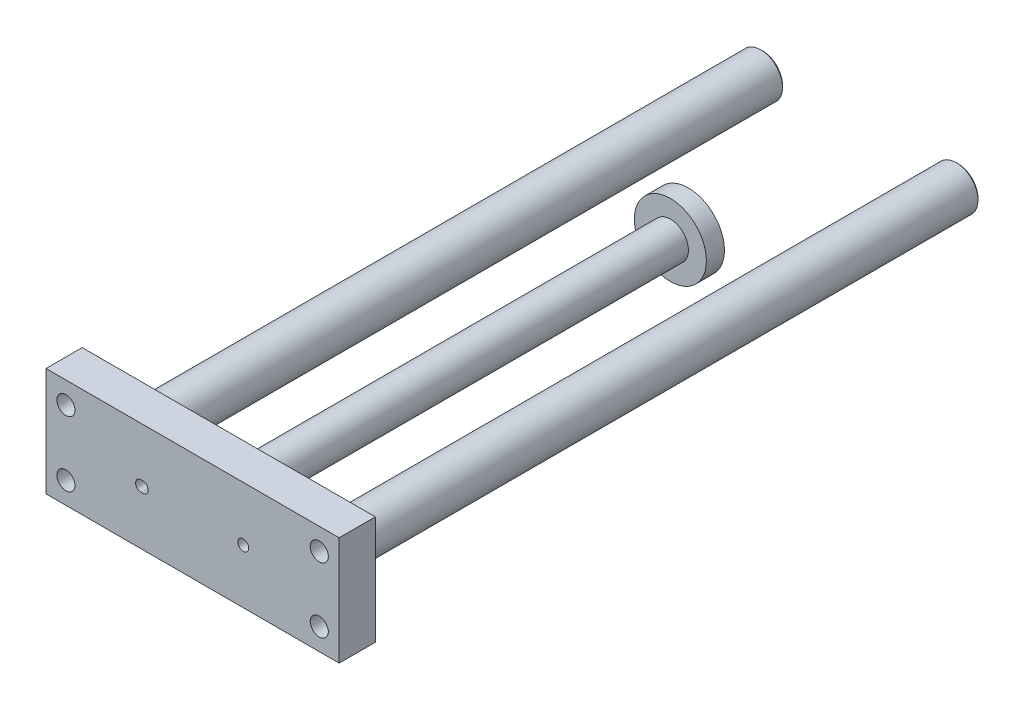
ISO-10303-21;
HEADER;
FILE_DESCRIPTION(('STEP AP214'),'2;1');
FILE_NAME('part.step','',(''),(''),'','','');
FILE_SCHEMA(('AUTOMOTIVE_DESIGN { 1 0 10303 214 1 1 1 1 }'));
ENDSEC;
DATA;
#1=APPLICATION_CONTEXT('core data for automotive mechanical design processes');
#2=APPLICATION_PROTOCOL_DEFINITION('international standard','automotive_design',2000,#1);
#3=PRODUCT_CONTEXT('',#1,'mechanical');
#4=PRODUCT('Part','Part','',(#3));
#5=PRODUCT_RELATED_PRODUCT_CATEGORY('part','',(#4));
#6=PRODUCT_DEFINITION_FORMATION('','',#4);
#7=PRODUCT_DEFINITION_CONTEXT('part definition',#1,'design');
#8=PRODUCT_DEFINITION('design','',#6,#7);
#9=PRODUCT_DEFINITION_SHAPE('','',#8);
#10=(LENGTH_UNIT() NAMED_UNIT(*) SI_UNIT(.MILLI.,.METRE.));
#11=(NAMED_UNIT(*) PLANE_ANGLE_UNIT() SI_UNIT($,.RADIAN.));
#12=(NAMED_UNIT(*) SI_UNIT($,.STERADIAN.) SOLID_ANGLE_UNIT());
#13=UNCERTAINTY_MEASURE_WITH_UNIT(LENGTH_MEASURE(1.E-05),#10,'distance_accuracy_value','');
#14=(GEOMETRIC_REPRESENTATION_CONTEXT(3) GLOBAL_UNCERTAINTY_ASSIGNED_CONTEXT((#13)) GLOBAL_UNIT_ASSIGNED_CONTEXT((#10,
#11,#12)) REPRESENTATION_CONTEXT('',''));
#15=CARTESIAN_POINT('',(0.,0.,0.));
#16=DIRECTION('',(0.,0.,1.));
#17=DIRECTION('',(1.,0.,0.));
#18=AXIS2_PLACEMENT_3D('',#15,#16,#17);
#19=CARTESIAN_POINT('',(-40.5,-15.,127.));
#20=DIRECTION('',(0.,0.,1.));
#21=DIRECTION('',(1.,0.,0.));
#22=AXIS2_PLACEMENT_3D('',#19,#20,#21);
#23=PLANE('',#22);
#24=CARTESIAN_POINT('',(-35.,-9.,127.));
#25=DIRECTION('',(0.,0.,1.));
#26=DIRECTION('',(1.,0.,0.));
#27=AXIS2_PLACEMENT_3D('',#24,#25,#26);
#28=CIRCLE('',#27,2.5);
#29=CARTESIAN_POINT('',(-32.5,-9.,127.));
#30=VERTEX_POINT('',#29);
#31=EDGE_CURVE('E159',#30,#30,#28,.T.);
#32=ORIENTED_EDGE('',*,*,#31,.T.);
#33=EDGE_LOOP('',(#32));
#34=FACE_BOUND('',#33,.T.);
#35=CARTESIAN_POINT('',(35.,-9.,127.));
#36=DIRECTION('',(0.,0.,1.));
#37=DIRECTION('',(1.,0.,0.));
#38=AXIS2_PLACEMENT_3D('',#35,#36,#37);
#39=CIRCLE('',#38,2.5);
#40=CARTESIAN_POINT('',(37.5,-9.,127.));
#41=VERTEX_POINT('',#40);
#42=EDGE_CURVE('E165',#41,#41,#39,.T.);
#43=ORIENTED_EDGE('',*,*,#42,.T.);
#44=EDGE_LOOP('',(#43));
#45=FACE_BOUND('',#44,.T.);
#46=CARTESIAN_POINT('',(-35.,9.,127.));
#47=DIRECTION('',(0.,0.,1.));
#48=DIRECTION('',(1.,0.,0.));
#49=AXIS2_PLACEMENT_3D('',#46,#47,#48);
#50=CIRCLE('',#49,2.5);
#51=CARTESIAN_POINT('',(-32.5,9.,127.));
#52=VERTEX_POINT('',#51);
#53=EDGE_CURVE('E171',#52,#52,#50,.T.);
#54=ORIENTED_EDGE('',*,*,#53,.T.);
#55=EDGE_LOOP('',(#54));
#56=FACE_BOUND('',#55,.T.);
#57=CARTESIAN_POINT('',(35.,9.,127.));
#58=DIRECTION('',(0.,0.,1.));
#59=DIRECTION('',(1.,0.,0.));
#60=AXIS2_PLACEMENT_3D('',#57,#58,#59);
#61=CIRCLE('',#60,2.5);
#62=CARTESIAN_POINT('',(37.5,9.,127.));
#63=VERTEX_POINT('',#62);
#64=EDGE_CURVE('E177',#63,#63,#61,.T.);
#65=ORIENTED_EDGE('',*,*,#64,.T.);
#66=EDGE_LOOP('',(#65));
#67=FACE_BOUND('',#66,.T.);
#68=CARTESIAN_POINT('',(27.,0.,127.));
#69=DIRECTION('',(0.,0.,1.));
#70=DIRECTION('',(1.,0.,0.));
#71=AXIS2_PLACEMENT_3D('',#68,#69,#70);
#72=CIRCLE('',#71,6.);
#73=CARTESIAN_POINT('',(33.,0.,127.));
#74=VERTEX_POINT('',#73);
#75=EDGE_CURVE('E222',#74,#74,#72,.F.);
#76=ORIENTED_EDGE('',*,*,#75,.F.);
#77=EDGE_LOOP('',(#76));
#78=FACE_BOUND('',#77,.T.);
#79=DIRECTION('',(0.,-1.,0.));
#80=VECTOR('',#79,1.);
#81=CARTESIAN_POINT('',(-40.5,15.,127.));
#82=LINE('',#81,#80);
#83=CARTESIAN_POINT('',(-40.5,15.,127.));
#84=VERTEX_POINT('',#83);
#85=CARTESIAN_POINT('',(-40.5,-15.,127.));
#86=VERTEX_POINT('',#85);
#87=EDGE_CURVE('E187',#84,#86,#82,.T.);
#88=ORIENTED_EDGE('',*,*,#87,.F.);
#89=DIRECTION('',(-1.,0.,0.));
#90=VECTOR('',#89,1.);
#91=CARTESIAN_POINT('',(-40.5,15.,127.));
#92=LINE('',#91,#90);
#93=CARTESIAN_POINT('',(40.5,15.,127.));
#94=VERTEX_POINT('',#93);
#95=EDGE_CURVE('E79',#94,#84,#92,.T.);
#96=ORIENTED_EDGE('',*,*,#95,.F.);
#97=DIRECTION('',(0.,1.,0.));
#98=VECTOR('',#97,1.);
#99=CARTESIAN_POINT('',(40.5,15.,127.));
#100=LINE('',#99,#98);
#101=CARTESIAN_POINT('',(40.5,-15.,127.));
#102=VERTEX_POINT('',#101);
#103=EDGE_CURVE('E201',#102,#94,#100,.T.);
#104=ORIENTED_EDGE('',*,*,#103,.F.);
#105=DIRECTION('',(1.,0.,0.));
#106=VECTOR('',#105,1.);
#107=CARTESIAN_POINT('',(-40.5,-15.,127.));
#108=LINE('',#107,#106);
#109=EDGE_CURVE('E199',#86,#102,#108,.T.);
#110=ORIENTED_EDGE('',*,*,#109,.F.);
#111=EDGE_LOOP('',(#88,#96,#104,#110));
#112=FACE_BOUND('',#111,.T.);
#113=CARTESIAN_POINT('',(0.,0.,127.));
#114=DIRECTION('',(0.,0.,1.));
#115=DIRECTION('',(1.,0.,0.));
#116=AXIS2_PLACEMENT_3D('',#113,#114,#115);
#117=CIRCLE('',#116,5.);
#118=CARTESIAN_POINT('',(5.,0.,127.));
#119=VERTEX_POINT('',#118);
#120=EDGE_CURVE('E212',#119,#119,#117,.T.);
#121=ORIENTED_EDGE('',*,*,#120,.T.);
#122=EDGE_LOOP('',(#121));
#123=FACE_BOUND('',#122,.T.);
#124=CARTESIAN_POINT('',(-27.,0.,127.));
#125=DIRECTION('',(0.,0.,1.));
#126=DIRECTION('',(1.,0.,0.));
#127=AXIS2_PLACEMENT_3D('',#124,#125,#126);
#128=CIRCLE('',#127,6.);
#129=CARTESIAN_POINT('',(-21.,0.,127.));
#130=VERTEX_POINT('',#129);
#131=EDGE_CURVE('E227',#130,#130,#128,.F.);
#132=ORIENTED_EDGE('',*,*,#131,.F.);
#133=EDGE_LOOP('',(#132));
#134=FACE_BOUND('',#133,.T.);
#135=ADVANCED_FACE('F34',(#34,#45,#56,#67,#78,#112,#123,#134),#23,.F.);
#136=CARTESIAN_POINT('',(0.,0.,5.));
#137=DIRECTION('',(0.,0.,1.));
#138=DIRECTION('',(1.,0.,0.));
#139=AXIS2_PLACEMENT_3D('',#136,#137,#138);
#140=PLANE('',#139);
#141=CARTESIAN_POINT('',(0.,0.,5.));
#142=DIRECTION('',(0.,0.,1.));
#143=DIRECTION('',(1.,0.,0.));
#144=AXIS2_PLACEMENT_3D('',#141,#142,#143);
#145=CIRCLE('',#144,9.95);
#146=CARTESIAN_POINT('',(9.95,0.,5.));
#147=VERTEX_POINT('',#146);
#148=EDGE_CURVE('E219',#147,#147,#145,.T.);
#149=ORIENTED_EDGE('',*,*,#148,.T.);
#150=EDGE_LOOP('',(#149));
#151=FACE_BOUND('',#150,.T.);
#152=CARTESIAN_POINT('',(0.,0.,5.));
#153=DIRECTION('',(0.,0.,1.));
#154=DIRECTION('',(1.,0.,0.));
#155=AXIS2_PLACEMENT_3D('',#152,#153,#154);
#156=CIRCLE('',#155,5.);
#157=CARTESIAN_POINT('',(5.,0.,5.));
#158=VERTEX_POINT('',#157);
#159=EDGE_CURVE('E215',#158,#158,#156,.F.);
#160=ORIENTED_EDGE('',*,*,#159,.T.);
#161=EDGE_LOOP('',(#160));
#162=FACE_BOUND('',#161,.T.);
#163=ADVANCED_FACE('F265',(#151,#162),#140,.T.);
#164=CARTESIAN_POINT('',(0.,0.,5.));
#165=DIRECTION('',(0.,0.,-1.));
#166=DIRECTION('',(-1.,0.,0.));
#167=AXIS2_PLACEMENT_3D('',#164,#165,#166);
#168=CYLINDRICAL_SURFACE('',#167,9.95);
#169=ORIENTED_EDGE('',*,*,#148,.F.);
#170=EDGE_LOOP('',(#169));
#171=FACE_BOUND('',#170,.T.);
#172=CARTESIAN_POINT('',(0.,0.,0.));
#173=DIRECTION('',(0.,0.,1.));
#174=DIRECTION('',(1.,0.,0.));
#175=AXIS2_PLACEMENT_3D('',#172,#173,#174);
#176=CIRCLE('',#175,9.95);
#177=CARTESIAN_POINT('',(9.95,0.,0.));
#178=VERTEX_POINT('',#177);
#179=EDGE_CURVE('E218',#178,#178,#176,.T.);
#180=ORIENTED_EDGE('',*,*,#179,.T.);
#181=EDGE_LOOP('',(#180));
#182=FACE_BOUND('',#181,.T.);
#183=ADVANCED_FACE('F271',(#171,#182),#168,.T.);
#184=CARTESIAN_POINT('',(0.,0.,0.));
#185=DIRECTION('',(0.,0.,1.));
#186=DIRECTION('',(1.,0.,0.));
#187=AXIS2_PLACEMENT_3D('',#184,#185,#186);
#188=PLANE('',#187);
#189=ORIENTED_EDGE('',*,*,#179,.F.);
#190=EDGE_LOOP('',(#189));
#191=FACE_BOUND('',#190,.T.);
#192=ADVANCED_FACE('F295',(#191),#188,.F.);
#193=CARTESIAN_POINT('',(0.,0.,141.142135623731));
#194=DIRECTION('',(0.,0.,-1.));
#195=DIRECTION('',(-1.,0.,0.));
#196=AXIS2_PLACEMENT_3D('',#193,#194,#195);
#197=CYLINDRICAL_SURFACE('',#196,5.);
#198=ORIENTED_EDGE('',*,*,#159,.F.);
#199=EDGE_LOOP('',(#198));
#200=FACE_BOUND('',#199,.T.);
#201=ORIENTED_EDGE('',*,*,#120,.F.);
#202=EDGE_LOOP('',(#201));
#203=FACE_BOUND('',#202,.T.);
#204=ADVANCED_FACE('F292',(#200,#203),#197,.T.);
#205=CARTESIAN_POINT('',(-40.5,15.,137.));
#206=DIRECTION('',(1.,0.,0.));
#207=DIRECTION('',(0.,0.,-1.));
#208=AXIS2_PLACEMENT_3D('',#205,#206,#207);
#209=PLANE('',#208);
#210=ORIENTED_EDGE('',*,*,#87,.T.);
#211=DIRECTION('',(0.,0.,-1.));
#212=VECTOR('',#211,1.);
#213=CARTESIAN_POINT('',(-40.5,-15.,137.));
#214=LINE('',#213,#212);
#215=CARTESIAN_POINT('',(-40.5,-15.,137.));
#216=VERTEX_POINT('',#215);
#217=EDGE_CURVE('E210',#216,#86,#214,.T.);
#218=ORIENTED_EDGE('',*,*,#217,.F.);
#219=DIRECTION('',(0.,-1.,0.));
#220=VECTOR('',#219,1.);
#221=CARTESIAN_POINT('',(-40.5,15.,137.));
#222=LINE('',#221,#220);
#223=CARTESIAN_POINT('',(-40.5,15.,137.));
#224=VERTEX_POINT('',#223);
#225=EDGE_CURVE('E190',#224,#216,#222,.T.);
#226=ORIENTED_EDGE('',*,*,#225,.F.);
#227=DIRECTION('',(0.,0.,-1.));
#228=VECTOR('',#227,1.);
#229=CARTESIAN_POINT('',(-40.5,15.,137.));
#230=LINE('',#229,#228);
#231=EDGE_CURVE('E196',#224,#84,#230,.T.);
#232=ORIENTED_EDGE('',*,*,#231,.T.);
#233=EDGE_LOOP('',(#210,#218,#226,#232));
#234=FACE_BOUND('',#233,.T.);
#235=ADVANCED_FACE('F289',(#234),#209,.F.);
#236=CARTESIAN_POINT('',(-40.5,-15.,137.));
#237=DIRECTION('',(0.,1.,0.));
#238=DIRECTION('',(0.,0.,1.));
#239=AXIS2_PLACEMENT_3D('',#236,#237,#238);
#240=PLANE('',#239);
#241=ORIENTED_EDGE('',*,*,#109,.T.);
#242=DIRECTION('',(0.,0.,-1.));
#243=VECTOR('',#242,1.);
#244=CARTESIAN_POINT('',(40.5,-15.,137.));
#245=LINE('',#244,#243);
#246=CARTESIAN_POINT('',(40.5,-15.,137.));
#247=VERTEX_POINT('',#246);
#248=EDGE_CURVE('E207',#247,#102,#245,.T.);
#249=ORIENTED_EDGE('',*,*,#248,.F.);
#250=DIRECTION('',(1.,0.,0.));
#251=VECTOR('',#250,1.);
#252=CARTESIAN_POINT('',(-40.5,-15.,137.));
#253=LINE('',#252,#251);
#254=EDGE_CURVE('E87',#216,#247,#253,.T.);
#255=ORIENTED_EDGE('',*,*,#254,.F.);
#256=ORIENTED_EDGE('',*,*,#217,.T.);
#257=EDGE_LOOP('',(#241,#249,#255,#256));
#258=FACE_BOUND('',#257,.T.);
#259=ADVANCED_FACE('F285',(#258),#240,.F.);
#260=CARTESIAN_POINT('',(40.5,15.,137.));
#261=DIRECTION('',(-1.,0.,0.));
#262=DIRECTION('',(0.,0.,1.));
#263=AXIS2_PLACEMENT_3D('',#260,#261,#262);
#264=PLANE('',#263);
#265=ORIENTED_EDGE('',*,*,#103,.T.);
#266=DIRECTION('',(0.,0.,-1.));
#267=VECTOR('',#266,1.);
#268=CARTESIAN_POINT('',(40.5,15.,137.));
#269=LINE('',#268,#267);
#270=CARTESIAN_POINT('',(40.5,15.,137.));
#271=VERTEX_POINT('',#270);
#272=EDGE_CURVE('E205',#271,#94,#269,.T.);
#273=ORIENTED_EDGE('',*,*,#272,.F.);
#274=DIRECTION('',(0.,1.,0.));
#275=VECTOR('',#274,1.);
#276=CARTESIAN_POINT('',(40.5,15.,137.));
#277=LINE('',#276,#275);
#278=EDGE_CURVE('E193',#247,#271,#277,.T.);
#279=ORIENTED_EDGE('',*,*,#278,.F.);
#280=ORIENTED_EDGE('',*,*,#248,.T.);
#281=EDGE_LOOP('',(#265,#273,#279,#280));
#282=FACE_BOUND('',#281,.T.);
#283=ADVANCED_FACE('F282',(#282),#264,.F.);
#284=CARTESIAN_POINT('',(-40.5,15.,137.));
#285=DIRECTION('',(0.,-1.,0.));
#286=DIRECTION('',(0.,0.,-1.));
#287=AXIS2_PLACEMENT_3D('',#284,#285,#286);
#288=PLANE('',#287);
#289=ORIENTED_EDGE('',*,*,#95,.T.);
#290=ORIENTED_EDGE('',*,*,#231,.F.);
#291=DIRECTION('',(-1.,0.,0.));
#292=VECTOR('',#291,1.);
#293=CARTESIAN_POINT('',(-40.5,15.,137.));
#294=LINE('',#293,#292);
#295=EDGE_CURVE('E58',#271,#224,#294,.T.);
#296=ORIENTED_EDGE('',*,*,#295,.F.);
#297=ORIENTED_EDGE('',*,*,#272,.T.);
#298=EDGE_LOOP('',(#289,#290,#296,#297));
#299=FACE_BOUND('',#298,.T.);
#300=ADVANCED_FACE('F279',(#299),#288,.F.);
#301=CARTESIAN_POINT('',(-40.5,-15.,137.));
#302=DIRECTION('',(0.,0.,1.));
#303=DIRECTION('',(1.,0.,0.));
#304=AXIS2_PLACEMENT_3D('',#301,#302,#303);
#305=PLANE('',#304);
#306=CARTESIAN_POINT('',(-13.75,0.,137.));
#307=DIRECTION('',(0.,0.,1.));
#308=DIRECTION('',(1.,0.,0.));
#309=AXIS2_PLACEMENT_3D('',#306,#307,#308);
#310=CIRCLE('',#309,1.5);
#311=CARTESIAN_POINT('',(-13.75,-1.5,137.));
#312=VERTEX_POINT('',#311);
#313=CARTESIAN_POINT('',(-13.75,1.5,137.));
#314=VERTEX_POINT('',#313);
#315=EDGE_CURVE('E122',#312,#314,#310,.T.);
#316=ORIENTED_EDGE('',*,*,#315,.F.);
#317=DIRECTION('',(1.,0.,0.));
#318=VECTOR('',#317,1.);
#319=CARTESIAN_POINT('',(-14.25,-1.5,137.));
#320=LINE('',#319,#318);
#321=CARTESIAN_POINT('',(-14.25,-1.5,137.));
#322=VERTEX_POINT('',#321);
#323=EDGE_CURVE('E136',#322,#312,#320,.T.);
#324=ORIENTED_EDGE('',*,*,#323,.F.);
#325=CARTESIAN_POINT('',(-14.25,0.,137.));
#326=DIRECTION('',(0.,0.,1.));
#327=DIRECTION('',(1.,0.,0.));
#328=AXIS2_PLACEMENT_3D('',#325,#326,#327);
#329=CIRCLE('',#328,1.5);
#330=CARTESIAN_POINT('',(-14.25,1.5,137.));
#331=VERTEX_POINT('',#330);
#332=EDGE_CURVE('E138',#331,#322,#329,.T.);
#333=ORIENTED_EDGE('',*,*,#332,.F.);
#334=DIRECTION('',(-1.,0.,0.));
#335=VECTOR('',#334,1.);
#336=CARTESIAN_POINT('',(-14.25,1.5,137.));
#337=LINE('',#336,#335);
#338=EDGE_CURVE('E146',#314,#331,#337,.T.);
#339=ORIENTED_EDGE('',*,*,#338,.F.);
#340=EDGE_LOOP('',(#316,#324,#333,#339));
#341=FACE_BOUND('',#340,.T.);
#342=CARTESIAN_POINT('',(-35.,-9.,137.));
#343=DIRECTION('',(0.,0.,1.));
#344=DIRECTION('',(-1.,0.,0.));
#345=AXIS2_PLACEMENT_3D('',#342,#343,#344);
#346=CIRCLE('',#345,2.5);
#347=CARTESIAN_POINT('',(-37.5,-9.,137.));
#348=VERTEX_POINT('',#347);
#349=EDGE_CURVE('E152',#348,#348,#346,.T.);
#350=ORIENTED_EDGE('',*,*,#349,.F.);
#351=EDGE_LOOP('',(#350));
#352=FACE_BOUND('',#351,.T.);
#353=CARTESIAN_POINT('',(35.,-9.,137.));
#354=DIRECTION('',(0.,0.,1.));
#355=DIRECTION('',(1.,0.,0.));
#356=AXIS2_PLACEMENT_3D('',#353,#354,#355);
#357=CIRCLE('',#356,2.5);
#358=CARTESIAN_POINT('',(37.5,-9.,137.));
#359=VERTEX_POINT('',#358);
#360=EDGE_CURVE('E162',#359,#359,#357,.T.);
#361=ORIENTED_EDGE('',*,*,#360,.F.);
#362=EDGE_LOOP('',(#361));
#363=FACE_BOUND('',#362,.T.);
#364=CARTESIAN_POINT('',(-35.,9.,137.));
#365=DIRECTION('',(0.,0.,1.));
#366=DIRECTION('',(-1.,0.,0.));
#367=AXIS2_PLACEMENT_3D('',#364,#365,#366);
#368=CIRCLE('',#367,2.5);
#369=CARTESIAN_POINT('',(-37.5,9.,137.));
#370=VERTEX_POINT('',#369);
#371=EDGE_CURVE('E168',#370,#370,#368,.T.);
#372=ORIENTED_EDGE('',*,*,#371,.F.);
#373=EDGE_LOOP('',(#372));
#374=FACE_BOUND('',#373,.T.);
#375=CARTESIAN_POINT('',(35.,9.,137.));
#376=DIRECTION('',(0.,0.,1.));
#377=DIRECTION('',(1.,0.,0.));
#378=AXIS2_PLACEMENT_3D('',#375,#376,#377);
#379=CIRCLE('',#378,2.5);
#380=CARTESIAN_POINT('',(37.5,9.,137.));
#381=VERTEX_POINT('',#380);
#382=EDGE_CURVE('E174',#381,#381,#379,.T.);
#383=ORIENTED_EDGE('',*,*,#382,.F.);
#384=EDGE_LOOP('',(#383));
#385=FACE_BOUND('',#384,.T.);
#386=CARTESIAN_POINT('',(14.,0.,137.));
#387=DIRECTION('',(0.,0.,1.));
#388=DIRECTION('',(1.,0.,0.));
#389=AXIS2_PLACEMENT_3D('',#386,#387,#388);
#390=CIRCLE('',#389,1.5);
#391=CARTESIAN_POINT('',(15.5,0.,137.));
#392=VERTEX_POINT('',#391);
#393=EDGE_CURVE('E183',#392,#392,#390,.T.);
#394=ORIENTED_EDGE('',*,*,#393,.F.);
#395=EDGE_LOOP('',(#394));
#396=FACE_BOUND('',#395,.T.);
#397=ORIENTED_EDGE('',*,*,#225,.T.);
#398=ORIENTED_EDGE('',*,*,#254,.T.);
#399=ORIENTED_EDGE('',*,*,#278,.T.);
#400=ORIENTED_EDGE('',*,*,#295,.T.);
#401=EDGE_LOOP('',(#397,#398,#399,#400));
#402=FACE_BOUND('',#401,.T.);
#403=ADVANCED_FACE('F277',(#341,#352,#363,#374,#385,#396,#402),#305,.T.);
#404=CARTESIAN_POINT('',(27.,0.,-64.4705627484771));
#405=DIRECTION('',(0.,0.,1.));
#406=DIRECTION('',(1.,0.,0.));
#407=AXIS2_PLACEMENT_3D('',#404,#405,#406);
#408=CYLINDRICAL_SURFACE('',#407,6.);
#409=CARTESIAN_POINT('',(27.,0.,-47.));
#410=DIRECTION('',(0.,0.,-1.));
#411=DIRECTION('',(-1.,0.,0.));
#412=AXIS2_PLACEMENT_3D('',#409,#410,#411);
#413=CIRCLE('',#412,6.);
#414=CARTESIAN_POINT('',(21.,0.,-47.));
#415=VERTEX_POINT('',#414);
#416=EDGE_CURVE('E233',#415,#415,#413,.F.);
#417=ORIENTED_EDGE('',*,*,#416,.T.);
#418=EDGE_LOOP('',(#417));
#419=FACE_BOUND('',#418,.T.);
#420=ORIENTED_EDGE('',*,*,#75,.T.);
#421=EDGE_LOOP('',(#420));
#422=FACE_BOUND('',#421,.T.);
#423=ADVANCED_FACE('F322',(#419,#422),#408,.T.);
#424=CARTESIAN_POINT('',(0.,0.,-47.5));
#425=DIRECTION('',(0.,0.,-1.));
#426=DIRECTION('',(-1.,0.,0.));
#427=AXIS2_PLACEMENT_3D('',#424,#425,#426);
#428=PLANE('',#427);
#429=CARTESIAN_POINT('',(27.,0.,-47.5));
#430=DIRECTION('',(0.,0.,-1.));
#431=DIRECTION('',(-1.,0.,0.));
#432=AXIS2_PLACEMENT_3D('',#429,#430,#431);
#433=CIRCLE('',#432,5.49999999999999);
#434=CARTESIAN_POINT('',(21.5,0.,-47.5));
#435=VERTEX_POINT('',#434);
#436=EDGE_CURVE('E230',#435,#435,#433,.T.);
#437=ORIENTED_EDGE('',*,*,#436,.T.);
#438=EDGE_LOOP('',(#437));
#439=FACE_BOUND('',#438,.T.);
#440=ADVANCED_FACE('F319',(#439),#428,.T.);
#441=CARTESIAN_POINT('',(-27.,0.,-64.4705627484771));
#442=DIRECTION('',(0.,0.,1.));
#443=DIRECTION('',(1.,0.,0.));
#444=AXIS2_PLACEMENT_3D('',#441,#442,#443);
#445=CYLINDRICAL_SURFACE('',#444,6.);
#446=CARTESIAN_POINT('',(-27.,0.,-47.));
#447=DIRECTION('',(0.,0.,-1.));
#448=DIRECTION('',(-1.,0.,0.));
#449=AXIS2_PLACEMENT_3D('',#446,#447,#448);
#450=CIRCLE('',#449,6.);
#451=CARTESIAN_POINT('',(-33.,0.,-47.));
#452=VERTEX_POINT('',#451);
#453=EDGE_CURVE('E238',#452,#452,#450,.F.);
#454=ORIENTED_EDGE('',*,*,#453,.T.);
#455=EDGE_LOOP('',(#454));
#456=FACE_BOUND('',#455,.T.);
#457=ORIENTED_EDGE('',*,*,#131,.T.);
#458=EDGE_LOOP('',(#457));
#459=FACE_BOUND('',#458,.T.);
#460=ADVANCED_FACE('F321',(#456,#459),#445,.T.);
#461=CARTESIAN_POINT('',(0.,0.,-47.5));
#462=DIRECTION('',(0.,0.,-1.));
#463=DIRECTION('',(-1.,0.,0.));
#464=AXIS2_PLACEMENT_3D('',#461,#462,#463);
#465=PLANE('',#464);
#466=CARTESIAN_POINT('',(-27.,0.,-47.5));
#467=DIRECTION('',(0.,0.,-1.));
#468=DIRECTION('',(-1.,0.,0.));
#469=AXIS2_PLACEMENT_3D('',#466,#467,#468);
#470=CIRCLE('',#469,5.49999999999999);
#471=CARTESIAN_POINT('',(-32.5,0.,-47.5));
#472=VERTEX_POINT('',#471);
#473=EDGE_CURVE('E236',#472,#472,#470,.T.);
#474=ORIENTED_EDGE('',*,*,#473,.T.);
#475=EDGE_LOOP('',(#474));
#476=FACE_BOUND('',#475,.T.);
#477=ADVANCED_FACE('F327',(#476),#465,.T.);
#478=CARTESIAN_POINT('',(14.,0.,131.));
#479=DIRECTION('',(0.,0.,1.));
#480=DIRECTION('',(1.,0.,0.));
#481=AXIS2_PLACEMENT_3D('',#478,#479,#480);
#482=CYLINDRICAL_SURFACE('',#481,1.5);
#483=CARTESIAN_POINT('',(14.,0.,131.));
#484=DIRECTION('',(0.,0.,1.));
#485=DIRECTION('',(1.,0.,0.));
#486=AXIS2_PLACEMENT_3D('',#483,#484,#485);
#487=CIRCLE('',#486,1.5);
#488=CARTESIAN_POINT('',(15.5,0.,131.));
#489=VERTEX_POINT('',#488);
#490=EDGE_CURVE('E184',#489,#489,#487,.T.);
#491=ORIENTED_EDGE('',*,*,#490,.F.);
#492=EDGE_LOOP('',(#491));
#493=FACE_BOUND('',#492,.T.);
#494=ORIENTED_EDGE('',*,*,#393,.T.);
#495=EDGE_LOOP('',(#494));
#496=FACE_BOUND('',#495,.T.);
#497=ADVANCED_FACE('F313',(#493,#496),#482,.F.);
#498=CARTESIAN_POINT('',(14.,0.,131.));
#499=DIRECTION('',(0.,0.,1.));
#500=DIRECTION('',(1.,0.,0.));
#501=AXIS2_PLACEMENT_3D('',#498,#499,#500);
#502=PLANE('',#501);
#503=ORIENTED_EDGE('',*,*,#490,.T.);
#504=EDGE_LOOP('',(#503));
#505=FACE_BOUND('',#504,.T.);
#506=ADVANCED_FACE('F305',(#505),#502,.T.);
#507=CARTESIAN_POINT('',(27.,0.,-47.5));
#508=DIRECTION('',(0.,0.,1.));
#509=DIRECTION('',(1.,0.,0.));
#510=AXIS2_PLACEMENT_3D('',#507,#508,#509);
#511=CONICAL_SURFACE('',#510,5.49999999999999,0.785398163397456);
#512=ORIENTED_EDGE('',*,*,#416,.F.);
#513=EDGE_LOOP('',(#512));
#514=FACE_BOUND('',#513,.T.);
#515=ORIENTED_EDGE('',*,*,#436,.F.);
#516=EDGE_LOOP('',(#515));
#517=FACE_BOUND('',#516,.T.);
#518=ADVANCED_FACE('F303',(#514,#517),#511,.T.);
#519=CARTESIAN_POINT('',(-27.,0.,-47.5));
#520=DIRECTION('',(0.,0.,1.));
#521=DIRECTION('',(1.,0.,0.));
#522=AXIS2_PLACEMENT_3D('',#519,#520,#521);
#523=CONICAL_SURFACE('',#522,5.49999999999999,0.785398163397456);
#524=ORIENTED_EDGE('',*,*,#453,.F.);
#525=EDGE_LOOP('',(#524));
#526=FACE_BOUND('',#525,.T.);
#527=ORIENTED_EDGE('',*,*,#473,.F.);
#528=EDGE_LOOP('',(#527));
#529=FACE_BOUND('',#528,.T.);
#530=ADVANCED_FACE('F36',(#526,#529),#523,.T.);
#531=CARTESIAN_POINT('',(35.,9.,-47.5));
#532=DIRECTION('',(0.,0.,1.));
#533=DIRECTION('',(1.,0.,0.));
#534=AXIS2_PLACEMENT_3D('',#531,#532,#533);
#535=CYLINDRICAL_SURFACE('',#534,2.5);
#536=ORIENTED_EDGE('',*,*,#382,.T.);
#537=EDGE_LOOP('',(#536));
#538=FACE_BOUND('',#537,.T.);
#539=ORIENTED_EDGE('',*,*,#64,.F.);
#540=EDGE_LOOP('',(#539));
#541=FACE_BOUND('',#540,.T.);
#542=ADVANCED_FACE('F311',(#538,#541),#535,.F.);
#543=CARTESIAN_POINT('',(-35.,9.,-47.5));
#544=DIRECTION('',(0.,0.,1.));
#545=DIRECTION('',(1.,0.,0.));
#546=AXIS2_PLACEMENT_3D('',#543,#544,#545);
#547=CYLINDRICAL_SURFACE('',#546,2.5);
#548=ORIENTED_EDGE('',*,*,#371,.T.);
#549=EDGE_LOOP('',(#548));
#550=FACE_BOUND('',#549,.T.);
#551=ORIENTED_EDGE('',*,*,#53,.F.);
#552=EDGE_LOOP('',(#551));
#553=FACE_BOUND('',#552,.T.);
#554=ADVANCED_FACE('F372',(#550,#553),#547,.F.);
#555=CARTESIAN_POINT('',(35.,-9.,-47.5));
#556=DIRECTION('',(0.,0.,1.));
#557=DIRECTION('',(1.,0.,0.));
#558=AXIS2_PLACEMENT_3D('',#555,#556,#557);
#559=CYLINDRICAL_SURFACE('',#558,2.5);
#560=ORIENTED_EDGE('',*,*,#360,.T.);
#561=EDGE_LOOP('',(#560));
#562=FACE_BOUND('',#561,.T.);
#563=ORIENTED_EDGE('',*,*,#42,.F.);
#564=EDGE_LOOP('',(#563));
#565=FACE_BOUND('',#564,.T.);
#566=ADVANCED_FACE('F382',(#562,#565),#559,.F.);
#567=CARTESIAN_POINT('',(-35.,-9.,-47.5));
#568=DIRECTION('',(0.,0.,1.));
#569=DIRECTION('',(1.,0.,0.));
#570=AXIS2_PLACEMENT_3D('',#567,#568,#569);
#571=CYLINDRICAL_SURFACE('',#570,2.5);
#572=ORIENTED_EDGE('',*,*,#349,.T.);
#573=EDGE_LOOP('',(#572));
#574=FACE_BOUND('',#573,.T.);
#575=ORIENTED_EDGE('',*,*,#31,.F.);
#576=EDGE_LOOP('',(#575));
#577=FACE_BOUND('',#576,.T.);
#578=ADVANCED_FACE('F388',(#574,#577),#571,.F.);
#579=CARTESIAN_POINT('',(-14.25,-1.5,134.));
#580=DIRECTION('',(0.,-1.,0.));
#581=DIRECTION('',(0.,0.,-1.));
#582=AXIS2_PLACEMENT_3D('',#579,#580,#581);
#583=PLANE('',#582);
#584=ORIENTED_EDGE('',*,*,#323,.T.);
#585=DIRECTION('',(0.,0.,1.));
#586=VECTOR('',#585,1.);
#587=CARTESIAN_POINT('',(-13.75,-1.5,134.));
#588=LINE('',#587,#586);
#589=CARTESIAN_POINT('',(-13.75,-1.5,134.));
#590=VERTEX_POINT('',#589);
#591=EDGE_CURVE('E150',#590,#312,#588,.T.);
#592=ORIENTED_EDGE('',*,*,#591,.F.);
#593=DIRECTION('',(1.,0.,0.));
#594=VECTOR('',#593,1.);
#595=CARTESIAN_POINT('',(-14.25,-1.5,134.));
#596=LINE('',#595,#594);
#597=CARTESIAN_POINT('',(-14.,-1.5,134.));
#598=VERTEX_POINT('',#597);
#599=EDGE_CURVE('E134',#598,#590,#596,.T.);
#600=ORIENTED_EDGE('',*,*,#599,.F.);
#601=CARTESIAN_POINT('',(-14.25,-1.5,134.));
#602=VERTEX_POINT('',#601);
#603=EDGE_CURVE('E125',#602,#598,#596,.T.);
#604=ORIENTED_EDGE('',*,*,#603,.F.);
#605=DIRECTION('',(0.,0.,1.));
#606=VECTOR('',#605,1.);
#607=CARTESIAN_POINT('',(-14.25,-1.5,134.));
#608=LINE('',#607,#606);
#609=EDGE_CURVE('E153',#602,#322,#608,.T.);
#610=ORIENTED_EDGE('',*,*,#609,.T.);
#611=EDGE_LOOP('',(#584,#592,#600,#604,#610));
#612=FACE_BOUND('',#611,.T.);
#613=ADVANCED_FACE('F247',(#612),#583,.F.);
#614=CARTESIAN_POINT('',(-14.25,1.5,134.));
#615=DIRECTION('',(0.,1.,0.));
#616=DIRECTION('',(0.,0.,1.));
#617=AXIS2_PLACEMENT_3D('',#614,#615,#616);
#618=PLANE('',#617);
#619=ORIENTED_EDGE('',*,*,#338,.T.);
#620=DIRECTION('',(0.,0.,1.));
#621=VECTOR('',#620,1.);
#622=CARTESIAN_POINT('',(-14.25,1.5,134.));
#623=LINE('',#622,#621);
#624=CARTESIAN_POINT('',(-14.25,1.5,134.));
#625=VERTEX_POINT('',#624);
#626=EDGE_CURVE('E124',#625,#331,#623,.T.);
#627=ORIENTED_EDGE('',*,*,#626,.F.);
#628=DIRECTION('',(-1.,0.,0.));
#629=VECTOR('',#628,1.);
#630=CARTESIAN_POINT('',(-14.25,1.5,134.));
#631=LINE('',#630,#629);
#632=CARTESIAN_POINT('',(-14.,1.5,134.));
#633=VERTEX_POINT('',#632);
#634=EDGE_CURVE('E129',#633,#625,#631,.T.);
#635=ORIENTED_EDGE('',*,*,#634,.F.);
#636=CARTESIAN_POINT('',(-13.75,1.5,134.));
#637=VERTEX_POINT('',#636);
#638=EDGE_CURVE('E49',#637,#633,#631,.T.);
#639=ORIENTED_EDGE('',*,*,#638,.F.);
#640=DIRECTION('',(0.,0.,1.));
#641=VECTOR('',#640,1.);
#642=CARTESIAN_POINT('',(-13.75,1.5,134.));
#643=LINE('',#642,#641);
#644=EDGE_CURVE('E117',#637,#314,#643,.T.);
#645=ORIENTED_EDGE('',*,*,#644,.T.);
#646=EDGE_LOOP('',(#619,#627,#635,#639,#645));
#647=FACE_BOUND('',#646,.T.);
#648=ADVANCED_FACE('F127',(#647),#618,.F.);
#649=CARTESIAN_POINT('',(-13.75,0.,134.));
#650=DIRECTION('',(0.,0.,1.));
#651=DIRECTION('',(1.,0.,0.));
#652=AXIS2_PLACEMENT_3D('',#649,#650,#651);
#653=PLANE('',#652);
#654=CARTESIAN_POINT('',(-14.,0.,134.));
#655=DIRECTION('',(0.,0.,1.));
#656=DIRECTION('',(1.,0.,0.));
#657=AXIS2_PLACEMENT_3D('',#654,#655,#656);
#658=CIRCLE('',#657,1.5);
#659=EDGE_CURVE('E11',#598,#633,#658,.F.);
#660=ORIENTED_EDGE('',*,*,#659,.T.);
#661=ORIENTED_EDGE('',*,*,#634,.T.);
#662=CARTESIAN_POINT('',(-14.25,0.,134.));
#663=DIRECTION('',(0.,0.,1.));
#664=DIRECTION('',(1.,0.,0.));
#665=AXIS2_PLACEMENT_3D('',#662,#663,#664);
#666=CIRCLE('',#665,1.5);
#667=EDGE_CURVE('E130',#625,#602,#666,.T.);
#668=ORIENTED_EDGE('',*,*,#667,.T.);
#669=ORIENTED_EDGE('',*,*,#603,.T.);
#670=EDGE_LOOP('',(#660,#661,#668,#669));
#671=FACE_BOUND('',#670,.T.);
#672=ADVANCED_FACE('F249',(#671),#653,.T.);
#673=EDGE_CURVE('E38',#633,#598,#658,.F.);
#674=ORIENTED_EDGE('',*,*,#673,.T.);
#675=ORIENTED_EDGE('',*,*,#599,.T.);
#676=CARTESIAN_POINT('',(-13.75,0.,134.));
#677=DIRECTION('',(0.,0.,1.));
#678=DIRECTION('',(1.,0.,0.));
#679=AXIS2_PLACEMENT_3D('',#676,#677,#678);
#680=CIRCLE('',#679,1.5);
#681=EDGE_CURVE('E120',#590,#637,#680,.T.);
#682=ORIENTED_EDGE('',*,*,#681,.T.);
#683=ORIENTED_EDGE('',*,*,#638,.T.);
#684=EDGE_LOOP('',(#674,#675,#682,#683));
#685=FACE_BOUND('',#684,.T.);
#686=ADVANCED_FACE('F132',(#685),#653,.T.);
#687=CARTESIAN_POINT('',(-13.75,0.,134.));
#688=DIRECTION('',(0.,0.,1.));
#689=DIRECTION('',(1.,0.,0.));
#690=AXIS2_PLACEMENT_3D('',#687,#688,#689);
#691=CYLINDRICAL_SURFACE('',#690,1.5);
#692=ORIENTED_EDGE('',*,*,#315,.T.);
#693=ORIENTED_EDGE('',*,*,#644,.F.);
#694=ORIENTED_EDGE('',*,*,#681,.F.);
#695=ORIENTED_EDGE('',*,*,#591,.T.);
#696=EDGE_LOOP('',(#692,#693,#694,#695));
#697=FACE_BOUND('',#696,.T.);
#698=ADVANCED_FACE('F118',(#697),#691,.F.);
#699=CARTESIAN_POINT('',(-14.25,0.,134.));
#700=DIRECTION('',(0.,0.,1.));
#701=DIRECTION('',(1.,0.,0.));
#702=AXIS2_PLACEMENT_3D('',#699,#700,#701);
#703=CYLINDRICAL_SURFACE('',#702,1.5);
#704=ORIENTED_EDGE('',*,*,#332,.T.);
#705=ORIENTED_EDGE('',*,*,#609,.F.);
#706=ORIENTED_EDGE('',*,*,#667,.F.);
#707=ORIENTED_EDGE('',*,*,#626,.T.);
#708=EDGE_LOOP('',(#704,#705,#706,#707));
#709=FACE_BOUND('',#708,.T.);
#710=ADVANCED_FACE('F259',(#709),#703,.F.);
#711=CARTESIAN_POINT('',(-14.,0.,131.));
#712=DIRECTION('',(0.,0.,-1.));
#713=DIRECTION('',(-1.,0.,0.));
#714=AXIS2_PLACEMENT_3D('',#711,#712,#713);
#715=PLANE('',#714);
#716=CARTESIAN_POINT('',(-14.,0.,131.));
#717=DIRECTION('',(0.,0.,1.));
#718=DIRECTION('',(-1.,0.,0.));
#719=AXIS2_PLACEMENT_3D('',#716,#717,#718);
#720=CIRCLE('',#719,1.5);
#721=CARTESIAN_POINT('',(-15.5,0.,131.));
#722=VERTEX_POINT('',#721);
#723=EDGE_CURVE('E180',#722,#722,#720,.T.);
#724=ORIENTED_EDGE('',*,*,#723,.T.);
#725=EDGE_LOOP('',(#724));
#726=FACE_BOUND('',#725,.T.);
#727=ADVANCED_FACE('F253',(#726),#715,.F.);
#728=CARTESIAN_POINT('',(-14.,0.,131.));
#729=DIRECTION('',(0.,0.,1.));
#730=DIRECTION('',(1.,0.,0.));
#731=AXIS2_PLACEMENT_3D('',#728,#729,#730);
#732=CYLINDRICAL_SURFACE('',#731,1.5);
#733=ORIENTED_EDGE('',*,*,#723,.F.);
#734=EDGE_LOOP('',(#733));
#735=FACE_BOUND('',#734,.T.);
#736=ORIENTED_EDGE('',*,*,#659,.F.);
#737=ORIENTED_EDGE('',*,*,#673,.F.);
#738=EDGE_LOOP('',(#736,#737));
#739=FACE_BOUND('',#738,.T.);
#740=ADVANCED_FACE('F251',(#735,#739),#732,.F.);
#741=CLOSED_SHELL('',(#135,#163,#183,#192,#204,#235,#259,#283,#300,#403,#423,#440,#460,#477,
#497,#506,#518,#530,#542,#554,#566,#578,#613,#648,#672,#686,#698,#710,#727,#740));
#742=MANIFOLD_SOLID_BREP('B2',#741);
#743=ADVANCED_BREP_SHAPE_REPRESENTATION('',(#18,#742),#14);
#744=SHAPE_DEFINITION_REPRESENTATION(#9,#743);
ENDSEC;
END-ISO-10303-21;
